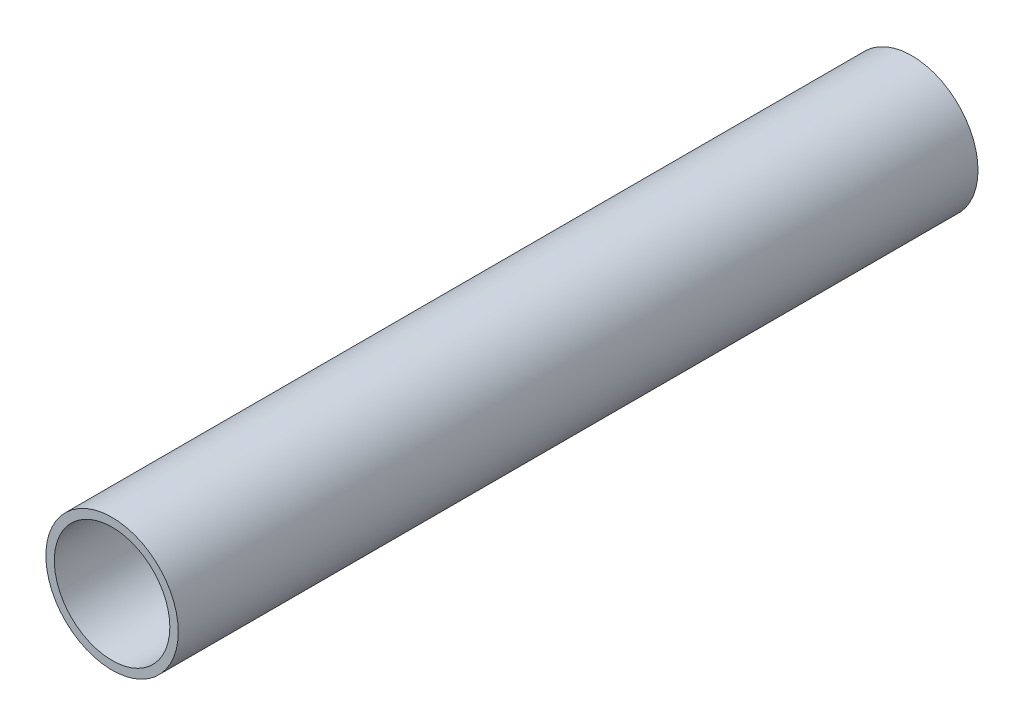
ISO-10303-21;
HEADER;
FILE_DESCRIPTION(('STEP AP214'),'2;1');
FILE_NAME('part.step','',(''),(''),'','','');
FILE_SCHEMA(('AUTOMOTIVE_DESIGN { 1 0 10303 214 1 1 1 1 }'));
ENDSEC;
DATA;
#1=APPLICATION_CONTEXT('core data for automotive mechanical design processes');
#2=APPLICATION_PROTOCOL_DEFINITION('international standard','automotive_design',2000,#1);
#3=PRODUCT_CONTEXT('',#1,'mechanical');
#4=PRODUCT('Part','Part','',(#3));
#5=PRODUCT_RELATED_PRODUCT_CATEGORY('part','',(#4));
#6=PRODUCT_DEFINITION_FORMATION('','',#4);
#7=PRODUCT_DEFINITION_CONTEXT('part definition',#1,'design');
#8=PRODUCT_DEFINITION('design','',#6,#7);
#9=PRODUCT_DEFINITION_SHAPE('','',#8);
#10=(LENGTH_UNIT() NAMED_UNIT(*) SI_UNIT(.MILLI.,.METRE.));
#11=(NAMED_UNIT(*) PLANE_ANGLE_UNIT() SI_UNIT($,.RADIAN.));
#12=(NAMED_UNIT(*) SI_UNIT($,.STERADIAN.) SOLID_ANGLE_UNIT());
#13=UNCERTAINTY_MEASURE_WITH_UNIT(LENGTH_MEASURE(1.E-05),#10,'distance_accuracy_value','');
#14=(GEOMETRIC_REPRESENTATION_CONTEXT(3) GLOBAL_UNCERTAINTY_ASSIGNED_CONTEXT((#13)) GLOBAL_UNIT_ASSIGNED_CONTEXT((#10,
#11,#12)) REPRESENTATION_CONTEXT('',''));
#15=CARTESIAN_POINT('',(0.,0.,0.));
#16=DIRECTION('',(0.,0.,1.));
#17=DIRECTION('',(1.,0.,0.));
#18=AXIS2_PLACEMENT_3D('',#15,#16,#17);
#19=CARTESIAN_POINT('',(0.,0.,228.6));
#20=DIRECTION('',(0.,0.,1.));
#21=DIRECTION('',(1.,0.,0.));
#22=AXIS2_PLACEMENT_3D('',#19,#20,#21);
#23=PLANE('',#22);
#24=CARTESIAN_POINT('',(0.,0.,228.6));
#25=DIRECTION('',(0.,0.,1.));
#26=DIRECTION('',(1.,0.,0.));
#27=AXIS2_PLACEMENT_3D('',#24,#25,#26);
#28=CIRCLE('',#27,18.923);
#29=CARTESIAN_POINT('',(18.923,0.,228.6));
#30=VERTEX_POINT('',#29);
#31=EDGE_CURVE('E10',#30,#30,#28,.T.);
#32=ORIENTED_EDGE('',*,*,#31,.T.);
#33=EDGE_LOOP('',(#32));
#34=FACE_BOUND('',#33,.T.);
#35=CARTESIAN_POINT('',(0.,0.,228.6));
#36=DIRECTION('',(0.,0.,1.));
#37=DIRECTION('',(1.,0.,0.));
#38=AXIS2_PLACEMENT_3D('',#35,#36,#37);
#39=CIRCLE('',#38,16.51);
#40=CARTESIAN_POINT('',(16.51,0.,228.6));
#41=VERTEX_POINT('',#40);
#42=EDGE_CURVE('E42',#41,#41,#39,.T.);
#43=ORIENTED_EDGE('',*,*,#42,.F.);
#44=EDGE_LOOP('',(#43));
#45=FACE_BOUND('',#44,.T.);
#46=ADVANCED_FACE('F31',(#34,#45),#23,.T.);
#47=CARTESIAN_POINT('',(0.,0.,0.));
#48=DIRECTION('',(0.,0.,1.));
#49=DIRECTION('',(1.,0.,0.));
#50=AXIS2_PLACEMENT_3D('',#47,#48,#49);
#51=PLANE('',#50);
#52=CARTESIAN_POINT('',(0.,0.,0.));
#53=DIRECTION('',(0.,0.,1.));
#54=DIRECTION('',(1.,0.,0.));
#55=AXIS2_PLACEMENT_3D('',#52,#53,#54);
#56=CIRCLE('',#55,18.923);
#57=CARTESIAN_POINT('',(18.923,0.,0.));
#58=VERTEX_POINT('',#57);
#59=EDGE_CURVE('E35',#58,#58,#56,.T.);
#60=ORIENTED_EDGE('',*,*,#59,.F.);
#61=EDGE_LOOP('',(#60));
#62=FACE_BOUND('',#61,.T.);
#63=CARTESIAN_POINT('',(0.,0.,0.));
#64=DIRECTION('',(0.,0.,1.));
#65=DIRECTION('',(1.,0.,0.));
#66=AXIS2_PLACEMENT_3D('',#63,#64,#65);
#67=CIRCLE('',#66,16.51);
#68=CARTESIAN_POINT('',(16.51,0.,0.));
#69=VERTEX_POINT('',#68);
#70=EDGE_CURVE('E44',#69,#69,#67,.T.);
#71=ORIENTED_EDGE('',*,*,#70,.T.);
#72=EDGE_LOOP('',(#71));
#73=FACE_BOUND('',#72,.T.);
#74=ADVANCED_FACE('F54',(#62,#73),#51,.F.);
#75=CARTESIAN_POINT('',(0.,0.,228.6));
#76=DIRECTION('',(0.,0.,-1.));
#77=DIRECTION('',(-1.,0.,0.));
#78=AXIS2_PLACEMENT_3D('',#75,#76,#77);
#79=CYLINDRICAL_SURFACE('',#78,18.923);
#80=ORIENTED_EDGE('',*,*,#31,.F.);
#81=EDGE_LOOP('',(#80));
#82=FACE_BOUND('',#81,.T.);
#83=ORIENTED_EDGE('',*,*,#59,.T.);
#84=EDGE_LOOP('',(#83));
#85=FACE_BOUND('',#84,.T.);
#86=ADVANCED_FACE('F33',(#82,#85),#79,.T.);
#87=CARTESIAN_POINT('',(0.,0.,228.6));
#88=DIRECTION('',(0.,0.,-1.));
#89=DIRECTION('',(-1.,0.,0.));
#90=AXIS2_PLACEMENT_3D('',#87,#88,#89);
#91=CYLINDRICAL_SURFACE('',#90,16.51);
#92=ORIENTED_EDGE('',*,*,#42,.T.);
#93=EDGE_LOOP('',(#92));
#94=FACE_BOUND('',#93,.T.);
#95=ORIENTED_EDGE('',*,*,#70,.F.);
#96=EDGE_LOOP('',(#95));
#97=FACE_BOUND('',#96,.T.);
#98=ADVANCED_FACE('F50',(#94,#97),#91,.F.);
#99=CLOSED_SHELL('',(#46,#74,#86,#98));
#100=MANIFOLD_SOLID_BREP('B2',#99);
#101=ADVANCED_BREP_SHAPE_REPRESENTATION('',(#18,#100),#14);
#102=SHAPE_DEFINITION_REPRESENTATION(#9,#101);
ENDSEC;
END-ISO-10303-21;
